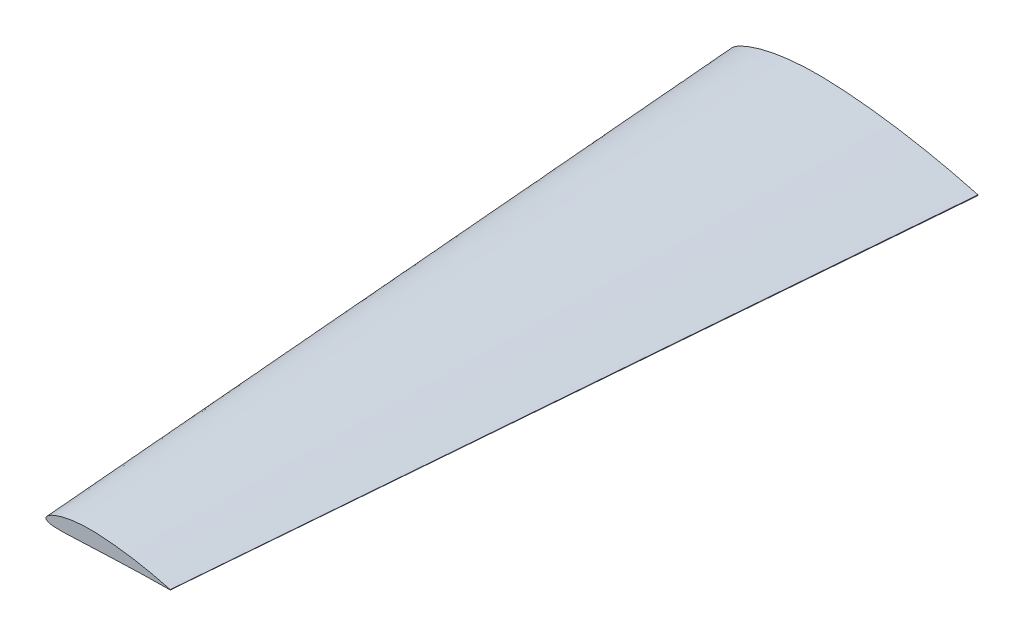
ISO-10303-21;
HEADER;
FILE_DESCRIPTION(('STEP AP214'),'2;1');
FILE_NAME('part.step','',(''),(''),'','','');
FILE_SCHEMA(('AUTOMOTIVE_DESIGN { 1 0 10303 214 1 1 1 1 }'));
ENDSEC;
DATA;
#1=APPLICATION_CONTEXT('core data for automotive mechanical design processes');
#2=APPLICATION_PROTOCOL_DEFINITION('international standard','automotive_design',2000,#1);
#3=PRODUCT_CONTEXT('',#1,'mechanical');
#4=PRODUCT('Part','Part','',(#3));
#5=PRODUCT_RELATED_PRODUCT_CATEGORY('part','',(#4));
#6=PRODUCT_DEFINITION_FORMATION('','',#4);
#7=PRODUCT_DEFINITION_CONTEXT('part definition',#1,'design');
#8=PRODUCT_DEFINITION('design','',#6,#7);
#9=PRODUCT_DEFINITION_SHAPE('','',#8);
#10=(LENGTH_UNIT() NAMED_UNIT(*) SI_UNIT(.MILLI.,.METRE.));
#11=(NAMED_UNIT(*) PLANE_ANGLE_UNIT() SI_UNIT($,.RADIAN.));
#12=(NAMED_UNIT(*) SI_UNIT($,.STERADIAN.) SOLID_ANGLE_UNIT());
#13=UNCERTAINTY_MEASURE_WITH_UNIT(LENGTH_MEASURE(1.E-05),#10,'distance_accuracy_value','');
#14=(GEOMETRIC_REPRESENTATION_CONTEXT(3) GLOBAL_UNCERTAINTY_ASSIGNED_CONTEXT((#13)) GLOBAL_UNIT_ASSIGNED_CONTEXT((#10,
#11,#12)) REPRESENTATION_CONTEXT('',''));
#15=CARTESIAN_POINT('',(0.,0.,0.));
#16=DIRECTION('',(0.,0.,1.));
#17=DIRECTION('',(1.,0.,0.));
#18=AXIS2_PLACEMENT_3D('',#15,#16,#17);
#19=CARTESIAN_POINT('',(63.9870246177536,1.46053907995175,762.));
#20=DIRECTION('',(0.,0.,-1.));
#21=DIRECTION('',(-1.,0.,0.));
#22=AXIS2_PLACEMENT_3D('',#19,#20,#21);
#23=PLANE('',#22);
#24=CARTESIAN_POINT('',(190.501135160856,0.159711835026969,762.));
#25=CARTESIAN_POINT('',(190.196401260815,0.242837402164437,762.));
#26=CARTESIAN_POINT('',(189.345713028998,0.474888846776531,762.));
#27=CARTESIAN_POINT('',(187.801897674633,0.888731591077363,762.));
#28=CARTESIAN_POINT('',(185.759703596292,1.42508607336304,762.));
#29=CARTESIAN_POINT('',(181.395978400603,2.54123887484926,762.));
#30=CARTESIAN_POINT('',(176.64296664211,3.67944944295744,762.));
#31=CARTESIAN_POINT('',(170.423544155164,5.06322299505257,762.));
#32=CARTESIAN_POINT('',(165.907465255672,6.00427842636629,762.));
#33=CARTESIAN_POINT('',(160.045021094237,7.14106385188569,762.));
#34=CARTESIAN_POINT('',(155.215065862349,8.00496895306485,762.));
#35=CARTESIAN_POINT('',(149.076874563435,9.00750201003734,762.));
#36=CARTESIAN_POINT('',(144.111464025191,9.73917687727197,762.));
#37=CARTESIAN_POINT('',(139.129785822539,10.3897489849181,762.));
#38=CARTESIAN_POINT('',(135.399257942975,10.8340394676828,762.));
#39=CARTESIAN_POINT('',(131.685194772388,11.2324457974397,762.));
#40=CARTESIAN_POINT('',(127.996916945445,11.583090543605,762.));
#41=CARTESIAN_POINT('',(124.3432909533,11.8842955510653,762.));
#42=CARTESIAN_POINT('',(120.732775279442,12.1352231638633,762.));
#43=CARTESIAN_POINT('',(117.173407661142,12.3331567906862,762.));
#44=CARTESIAN_POINT('',(113.673279114104,12.4835934855875,762.));
#45=CARTESIAN_POINT('',(110.238900031643,12.5608519442072,762.));
#46=CARTESIAN_POINT('',(106.87792211934,12.559053218761,762.));
#47=CARTESIAN_POINT('',(103.597426735289,12.4821109783776,762.));
#48=CARTESIAN_POINT('',(100.404089450189,12.3320110798951,762.));
#49=CARTESIAN_POINT('',(97.3043914555765,12.1117189870823,762.));
#50=CARTESIAN_POINT('',(94.3045933266868,11.8246590003456,762.));
#51=CARTESIAN_POINT('',(91.410791663912,11.4745298346542,762.));
#52=CARTESIAN_POINT('',(88.6288958848079,11.0655278010128,762.));
#53=CARTESIAN_POINT('',(85.9646564318204,10.6021781245193,762.));
#54=CARTESIAN_POINT('',(83.423666294842,10.0892992981837,762.));
#55=CARTESIAN_POINT('',(81.0113799330289,9.53200275937579,762.));
#56=CARTESIAN_POINT('',(78.7330948960282,8.93566545048852,762.));
#57=CARTESIAN_POINT('',(76.5939937255128,8.30575457375266,762.));
#58=CARTESIAN_POINT('',(74.5991224469136,7.64789101891847,762.));
#59=CARTESIAN_POINT('',(72.7533622745058,6.96779556599871,762.));
#60=CARTESIAN_POINT('',(71.0615072897458,6.27106121856356,762.));
#61=CARTESIAN_POINT('',(69.528158004084,5.56326086551171,762.));
#62=CARTESIAN_POINT('',(68.15777389568,4.84972614842419,762.));
#63=CARTESIAN_POINT('',(66.9545825796964,4.13549625566344,762.));
#64=CARTESIAN_POINT('',(65.9225345441201,3.42515574841331,762.));
#65=CARTESIAN_POINT('',(65.0652400837754,2.72254666043556,762.));
#66=CARTESIAN_POINT('',(64.3858924088571,2.03027344065209,762.));
#67=CARTESIAN_POINT('',(63.8877954466128,1.34882803370603,762.));
#68=CARTESIAN_POINT('',(63.576331156455,0.675261661187566,762.));
#69=CARTESIAN_POINT('',(63.465822923462,0.0133890151793681,762.));
#70=CARTESIAN_POINT('',(63.5650901962065,-0.61763644203103,762.));
#71=CARTESIAN_POINT('',(63.8798671557874,-1.18666144174842,762.));
#72=CARTESIAN_POINT('',(64.387131186621,-1.68063514166978,762.));
#73=CARTESIAN_POINT('',(65.0727851050754,-2.10996667588219,762.));
#74=CARTESIAN_POINT('',(65.9333575925368,-2.4826496151927,762.));
#75=CARTESIAN_POINT('',(66.966748162396,-2.80280567086735,762.));
#76=CARTESIAN_POINT('',(68.1702808429811,-3.07284699802537,762.));
#77=CARTESIAN_POINT('',(69.5405071897431,-3.29457314167147,762.));
#78=CARTESIAN_POINT('',(71.0734430813331,-3.4698766276928,762.));
#79=CARTESIAN_POINT('',(72.7647592058337,-3.60075846595504,762.));
#80=CARTESIAN_POINT('',(74.6098960421376,-3.68939432383372,762.));
#81=CARTESIAN_POINT('',(76.6040996851897,-3.73829785785436,762.));
#82=CARTESIAN_POINT('',(78.7424790794674,-3.75015903606364,762.));
#83=CARTESIAN_POINT('',(81.0199929939404,-3.72796926564423,762.));
#84=CARTESIAN_POINT('',(83.4314693802842,-3.67497138461213,762.));
#85=CARTESIAN_POINT('',(85.9716012917116,-3.59462091577072,762.));
#86=CARTESIAN_POINT('',(88.63493909563,-3.49062839467568,762.));
#87=CARTESIAN_POINT('',(91.4159007115907,-3.36697433226066,762.));
#88=CARTESIAN_POINT('',(94.3087375578435,-3.22768808252554,762.));
#89=CARTESIAN_POINT('',(97.3075514533232,-3.07714046090769,762.));
#90=CARTESIAN_POINT('',(100.406260655434,-2.91966806654462,762.));
#91=CARTESIAN_POINT('',(103.598610516816,-2.75979050739913,762.));
#92=CARTESIAN_POINT('',(106.878142898574,-2.60211997330187,762.));
#93=CARTESIAN_POINT('',(110.238165944358,-2.45069676719206,762.));
#94=CARTESIAN_POINT('',(113.671950709812,-2.31182349124203,762.));
#95=CARTESIAN_POINT('',(117.172359913805,-2.1825344844191,762.));
#96=CARTESIAN_POINT('',(120.731314943635,-2.04023922618981,762.));
#97=CARTESIAN_POINT('',(124.341529513328,-1.89379524646238,762.));
#98=CARTESIAN_POINT('',(129.233791184049,-1.69325168180308,762.));
#99=CARTESIAN_POINT('',(134.166282729182,-1.49318365192342,762.));
#100=CARTESIAN_POINT('',(139.127032284791,-1.30096396691693,762.));
#101=CARTESIAN_POINT('',(144.104534567907,-1.11598363859952,762.));
#102=CARTESIAN_POINT('',(150.288028508105,-0.90382420606474,762.));
#103=CARTESIAN_POINT('',(156.426163442723,-0.72199180046078,762.));
#104=CARTESIAN_POINT('',(162.405617828801,-0.567558932633419,762.));
#105=CARTESIAN_POINT('',(168.122531429816,-0.441227955508521,762.));
#106=CARTESIAN_POINT('',(174.624833220152,-0.328170672402782,762.));
#107=CARTESIAN_POINT('',(179.690292359278,-0.260565816368084,762.));
#108=CARTESIAN_POINT('',(183.370643476354,-0.220528573977313,762.));
#109=CARTESIAN_POINT('',(185.7578348823,-0.19768773229364,762.));
#110=CARTESIAN_POINT('',(187.800598147419,-0.18039888701402,762.));
#111=CARTESIAN_POINT('',(189.345002999198,-0.168516617090277,762.));
#112=CARTESIAN_POINT('',(190.196357675296,-0.162488896159163,762.));
#113=CARTESIAN_POINT('',(190.50113516071,-0.16033102508646,762.));
#114=B_SPLINE_CURVE_WITH_KNOTS('',3,(#24,#25,#26,#27,#28,#29,#30,#31,#32,#33,#34,#35,#36,#37,
#38,#39,#40,#41,#42,#43,#44,#45,#46,#47,#48,#49,#50,#51,#52,#53,#54,#55,#56,#57,#58,#59,#60,#61,
#62,#63,#64,#65,#66,#67,#68,#69,#70,#71,#72,#73,#74,#75,#76,#77,#78,#79,#80,#81,#82,#83,#84,#85,
#86,#87,#88,#89,#90,#91,#92,#93,#94,#95,#96,#97,#98,#99,#100,#101,#102,#103,#104,#105,#106,#107,
#108,#109,#110,#111,#112,#113),.UNSPECIFIED.,.F.,.F.,(4,1,1,1,1,1,1,1,1,1,1,1,1,1,1,1,1,1,1,1,1,
1,1,1,1,1,1,1,1,1,1,1,1,1,1,1,1,1,1,1,1,1,1,1,1,1,1,1,1,1,1,1,1,1,1,1,1,1,1,1,1,1,1,1,1,1,1,1,1,
1,1,1,1,1,1,1,1,1,1,1,1,1,1,1,1,1,1,4),(0.,0.00364478860601825,0.0101747090631396,
0.0184428895215231,0.0280086425425611,0.0621482051960464,0.0748342744760799,0.101528263852082,
0.11537602387302,0.143739831555727,0.158142445863791,0.187141630275424,0.201650652685618,
0.216112766088313,0.230491315406633,0.244751958245146,0.258862484994308,0.272792304761907,
0.286512736995745,0.299996338841716,0.313215703909648,0.326148553126901,0.338775131713446,
0.351076262527233,0.363033565222517,0.37462915444481,0.385845411815831,0.396664985336227,
0.407070812724617,0.417045766343156,0.426572937786423,0.435635427001241,0.444216489802456,
0.452299728153717,0.459869106397838,0.466909557106952,0.473407118007064,0.479350051113446,
0.484729721235626,0.48954271443065,0.493793733281505,0.497501096756629,0.500706184991412,
0.503488944623097,0.505988254688667,0.508338044066672,0.510717789225009,0.513359374079945,
0.516423742324159,0.520004745754894,0.524152160678046,0.528889812630103,0.534226438538837,
0.540161492649376,0.546688627737685,0.553797384371451,0.561474607341898,0.569704904431302,
0.578471268576388,0.587755198196961,0.597537024239713,0.60779607747483,0.618510576434459,
0.629658046042943,0.641215051436608,0.653157357960514,0.665460089527627,0.67809762264025,
0.691043448063763,0.704270528446116,0.717752207957266,0.731462063587203,0.745369962337874,
0.759444617882347,0.787961110672762,0.802332596700765,0.816729476151824,0.84543596003295,
0.873725531950303,0.887588045862428,0.914455616234269,0.939708694258762,0.962629026381722,
0.972910877872026,0.982178639029259,0.990176001122399,0.996483094815023,1.),.UNSPECIFIED.);
#115=CARTESIAN_POINT('',(190.501135161374,0.159710881655824,762.));
#116=VERTEX_POINT('',#115);
#117=CARTESIAN_POINT('',(190.501135161301,-0.160330071715315,762.));
#118=VERTEX_POINT('',#117);
#119=EDGE_CURVE('E63',#116,#118,#114,.T.);
#120=ORIENTED_EDGE('',*,*,#119,.T.);
#121=DIRECTION('',(-2.28433846985782E-10,-1.,0.));
#122=VECTOR('',#121,1.);
#123=CARTESIAN_POINT('',(190.501135161374,0.159710881655824,762.));
#124=LINE('',#123,#122);
#125=EDGE_CURVE('E12',#116,#118,#124,.T.);
#126=ORIENTED_EDGE('',*,*,#125,.F.);
#127=EDGE_LOOP('',(#120,#126));
#128=FACE_BOUND('',#127,.T.);
#129=ADVANCED_FACE('F53',(#128),#23,.F.);
#130=CARTESIAN_POINT('',(0.97404013916288,2.92167112415054,0.));
#131=DIRECTION('',(0.,0.,-1.));
#132=DIRECTION('',(-1.,0.,0.));
#133=AXIS2_PLACEMENT_3D('',#130,#131,#132);
#134=PLANE('',#133);
#135=CARTESIAN_POINT('',(254.,0.32004,0.));
#136=CARTESIAN_POINT('',(253.390537646446,0.486289648267037,0.));
#137=CARTESIAN_POINT('',(251.689176387219,0.950388389185326,0.));
#138=CARTESIAN_POINT('',(248.601573271209,1.77806647963455,0.));
#139=CARTESIAN_POINT('',(244.517221614816,2.85076585590718,0.));
#140=CARTESIAN_POINT('',(235.789849216653,5.08305150554154,0.));
#141=CARTESIAN_POINT('',(226.283910650703,7.35945229381868,0.));
#142=CARTESIAN_POINT('',(213.845176837243,10.1269746597052,0.));
#143=CARTESIAN_POINT('',(204.813099754701,12.0090686984258,0.));
#144=CARTESIAN_POINT('',(193.088316212104,14.2826192259836,0.));
#145=CARTESIAN_POINT('',(183.428492074849,16.0104139830805,0.));
#146=CARTESIAN_POINT('',(171.152219185932,18.0154621728274,0.));
#147=CARTESIAN_POINT('',(161.221486857123,19.4787988253041,0.));
#148=CARTESIAN_POINT('',(151.25821949033,20.779931408164,0.));
#149=CARTESIAN_POINT('',(143.797230407695,21.6685044293409,0.));
#150=CARTESIAN_POINT('',(136.369170448777,22.465309964619,0.));
#151=CARTESIAN_POINT('',(128.992680716324,23.1665931863953,0.));
#152=CARTESIAN_POINT('',(121.685494034167,23.7689978144454,0.));
#153=CARTESIAN_POINT('',(114.464527218106,24.270848551834,0.));
#154=CARTESIAN_POINT('',(107.345855599024,24.6667122644973,0.));
#155=CARTESIAN_POINT('',(100.34566106371,24.9675829622992,0.));
#156=CARTESIAN_POINT('',(93.4769642824573,25.1220984955356,0.));
#157=CARTESIAN_POINT('',(86.7550685296698,25.1185010737212,0.));
#158=CARTESIAN_POINT('',(80.1941363949661,24.9646179651698,0.));
#159=CARTESIAN_POINT('',(73.8075189004262,24.6644208480695,0.));
#160=CARTESIAN_POINT('',(67.6081783132815,24.2238405969616,0.));
#161=CARTESIAN_POINT('',(61.6086356721016,23.6497257514606,0.));
#162=CARTESIAN_POINT('',(55.8210840687007,22.9494736754026,0.));
#163=CARTESIAN_POINT('',(50.257342232566,22.1314769157999,0.));
#164=CARTESIAN_POINT('',(44.9289109458054,21.204785841973,0.));
#165=CARTESIAN_POINT('',(39.8469760882345,20.1790373538249,0.));
#166=CARTESIAN_POINT('',(35.0224464806717,19.0644542347415,0.));
#167=CARTESIAN_POINT('',(30.4659171277217,17.8717902734098,0.));
#168=CARTESIAN_POINT('',(26.1877530200956,16.611979776579,0.));
#169=CARTESIAN_POINT('',(22.1980461184611,15.2962644232903,0.));
#170=CARTESIAN_POINT('',(18.5065587641201,13.9360856713245,0.));
#171=CARTESIAN_POINT('',(15.1228790342938,12.5426294278608,0.));
#172=CARTESIAN_POINT('',(12.056207869652,11.1270413710947,0.));
#173=CARTESIAN_POINT('',(9.31546414680269,9.69998468889821,0.));
#174=CARTESIAN_POINT('',(6.90910302050575,8.27153766793319,0.));
#175=CARTESIAN_POINT('',(4.84502539612194,6.85086934862954,0.));
#176=CARTESIAN_POINT('',(3.13045179876857,5.4456637298443,0.));
#177=CARTESIAN_POINT('',(1.77176859175951,4.06112966287395,0.));
#178=CARTESIAN_POINT('',(0.775583570537433,2.69825102821515,0.));
#179=CARTESIAN_POINT('',(0.152660557736857,1.3511303217576,0.));
#180=CARTESIAN_POINT('',(-0.0683539324959022,0.0273968594985317,0.));
#181=CARTESIAN_POINT('',(0.130178839334364,-1.23464277631474,0.));
#182=CARTESIAN_POINT('',(0.759727132908438,-2.37268260509879,0.));
#183=CARTESIAN_POINT('',(1.77424612853707,-3.36062117553042,0.));
#184=CARTESIAN_POINT('',(3.14554171092971,-4.21927656975095,0.));
#185=CARTESIAN_POINT('',(4.86667130490995,-4.964635786506,0.));
#186=CARTESIAN_POINT('',(6.93343397480551,-5.60494217466098,0.));
#187=CARTESIAN_POINT('',(9.3404778251038,-6.14502000134356,0.));
#188=CARTESIAN_POINT('',(12.0809060283431,-6.58846832440248,0.));
#189=CARTESIAN_POINT('',(15.1467504130371,-6.93907216178997,0.));
#190=CARTESIAN_POINT('',(18.5293524327319,-7.20083349747666,0.));
#191=CARTESIAN_POINT('',(22.2195931267088,-7.37810362733138,0.));
#192=CARTESIAN_POINT('',(26.2079647698278,-7.47590981948216,0.));
#193=CARTESIAN_POINT('',(30.4846853384653,-7.49963196194819,0.));
#194=CARTESIAN_POINT('',(35.0396724606673,-7.45525281563302,0.));
#195=CARTESIAN_POINT('',(39.8625821322293,-7.34925799861311,0.));
#196=CARTESIAN_POINT('',(44.9428005544326,-7.18855849473847,0.));
#197=CARTESIAN_POINT('',(50.2694285594988,-6.98057530880581,0.));
#198=CARTESIAN_POINT('',(55.8313020863041,-6.73326939154266,0.));
#199=CARTESIAN_POINT('',(61.6169240740981,-6.45469937893608,0.));
#200=CARTESIAN_POINT('',(67.6144982661743,-6.15360682374524,0.));
#201=CARTESIAN_POINT('',(73.8118612860454,-5.83866484674134,0.));
#202=CARTESIAN_POINT('',(80.1965039507901,-5.51891258307528,0.));
#203=CARTESIAN_POINT('',(86.7555100980449,-5.20357432997919,0.));
#204=CARTESIAN_POINT('',(93.4754961347248,-4.900730621124,0.));
#205=CARTESIAN_POINT('',(100.34300429239,-4.62298654821206,0.));
#206=CARTESIAN_POINT('',(107.34376013634,-4.36441084219083,0.));
#207=CARTESIAN_POINT('',(114.461606585545,-4.07982286576818,0.));
#208=CARTESIAN_POINT('',(121.681971198295,-3.78693752045383,0.));
#209=CARTESIAN_POINT('',(131.46640709862,-3.38585397104318,0.));
#210=CARTESIAN_POINT('',(141.331302028729,-2.98572148265566,0.));
#211=CARTESIAN_POINT('',(151.252712474731,-2.60128554371272,0.));
#212=CARTESIAN_POINT('',(161.207628076326,-2.23132818874134,0.));
#213=CARTESIAN_POINT('',(173.574505436994,-1.80701311001391,0.));
#214=CARTESIAN_POINT('',(185.850665597245,-1.44335154314506,0.));
#215=CARTESIAN_POINT('',(197.809467496588,-1.13448856225385,0.));
#216=CARTESIAN_POINT('',(209.243192518303,-0.881828860733514,0.));
#217=CARTESIAN_POINT('',(222.247679881184,-0.655716309288913,0.));
#218=CARTESIAN_POINT('',(232.378507622826,-0.52050780091379,0.));
#219=CARTESIAN_POINT('',(239.739144076866,-0.440434028367526,0.));
#220=CARTESIAN_POINT('',(244.513484221714,-0.394752751060409,0.));
#221=CARTESIAN_POINT('',(248.598974240985,-0.36017536764354,0.));
#222=CARTESIAN_POINT('',(251.687756340897,-0.336411038760385,0.));
#223=CARTESIAN_POINT('',(253.390450476558,-0.324355703855585,0.));
#224=CARTESIAN_POINT('',(254.,-0.32004,0.));
#225=B_SPLINE_CURVE_WITH_KNOTS('',3,(#135,#136,#137,#138,#139,#140,#141,#142,#143,#144,#145,
#146,#147,#148,#149,#150,#151,#152,#153,#154,#155,#156,#157,#158,#159,#160,#161,#162,#163,#164,
#165,#166,#167,#168,#169,#170,#171,#172,#173,#174,#175,#176,#177,#178,#179,#180,#181,#182,#183,
#184,#185,#186,#187,#188,#189,#190,#191,#192,#193,#194,#195,#196,#197,#198,#199,#200,#201,#202,
#203,#204,#205,#206,#207,#208,#209,#210,#211,#212,#213,#214,#215,#216,#217,#218,#219,#220,#221,
#222,#223,#224),.UNSPECIFIED.,.F.,.F.,(4,1,1,1,1,1,1,1,1,1,1,1,1,1,1,1,1,1,1,1,1,1,1,1,1,1,1,1,
1,1,1,1,1,1,1,1,1,1,1,1,1,1,1,1,1,1,1,1,1,1,1,1,1,1,1,1,1,1,1,1,1,1,1,1,1,1,1,1,1,1,1,1,1,1,1,1,
1,1,1,1,1,1,1,1,1,1,1,4),(0.,0.00364478860601825,0.0101747090631396,0.0184428895215231,
0.0280086425425611,0.0621482051960464,0.0748342744760799,0.101528263852082,0.11537602387302,
0.143739831555727,0.158142445863791,0.187141630275424,0.201650652685618,0.216112766088313,
0.230491315406633,0.244751958245146,0.258862484994308,0.272792304761907,0.286512736995745,
0.299996338841716,0.313215703909648,0.326148553126901,0.338775131713446,0.351076262527233,
0.363033565222517,0.37462915444481,0.385845411815831,0.396664985336227,0.407070812724617,
0.417045766343156,0.426572937786423,0.435635427001241,0.444216489802456,0.452299728153717,
0.459869106397838,0.466909557106952,0.473407118007064,0.479350051113446,0.484729721235626,
0.48954271443065,0.493793733281505,0.497501096756629,0.500706184991412,0.503488944623097,
0.505988254688667,0.508338044066672,0.510717789225009,0.513359374079945,0.516423742324159,
0.520004745754894,0.524152160678046,0.528889812630103,0.534226438538837,0.540161492649376,
0.546688627737685,0.553797384371451,0.561474607341898,0.569704904431302,0.578471268576388,
0.587755198196961,0.597537024239713,0.60779607747483,0.618510576434459,0.629658046042943,
0.641215051436608,0.653157357960514,0.665460089527627,0.67809762264025,0.691043448063763,
0.704270528446116,0.717752207957266,0.731462063587203,0.745369962337874,0.759444617882347,
0.787961110672762,0.802332596700765,0.816729476151824,0.84543596003295,0.873725531950303,
0.887588045862428,0.914455616234269,0.939708694258762,0.962629026381722,0.972910877872026,
0.982178639029259,0.990176001122399,0.996483094815023,1.),.UNSPECIFIED.);
#226=CARTESIAN_POINT('',(254.,0.32004,0.));
#227=VERTEX_POINT('',#226);
#228=CARTESIAN_POINT('',(254.,-0.32004,0.));
#229=VERTEX_POINT('',#228);
#230=EDGE_CURVE('E87',#227,#229,#225,.T.);
#231=ORIENTED_EDGE('',*,*,#230,.F.);
#232=DIRECTION('',(0.,1.,0.));
#233=VECTOR('',#232,1.);
#234=CARTESIAN_POINT('',(254.,0.32004,0.));
#235=LINE('',#234,#233);
#236=EDGE_CURVE('E91',#229,#227,#235,.T.);
#237=ORIENTED_EDGE('',*,*,#236,.F.);
#238=EDGE_LOOP('',(#231,#237));
#239=FACE_BOUND('',#238,.T.);
#240=ADVANCED_FACE('F100',(#239),#134,.T.);
#241=CARTESIAN_POINT('',(254.,0.32004,0.));
#242=CARTESIAN_POINT('',(190.501135160856,0.159711835026969,762.));
#243=CARTESIAN_POINT('',(253.390537646446,0.486289648267037,0.));
#244=CARTESIAN_POINT('',(190.196401260815,0.242837402164437,762.));
#245=CARTESIAN_POINT('',(251.689176387219,0.950388389185326,0.));
#246=CARTESIAN_POINT('',(189.345713028998,0.474888846776531,762.));
#247=CARTESIAN_POINT('',(248.601573271209,1.77806647963455,0.));
#248=CARTESIAN_POINT('',(187.801897674633,0.888731591077363,762.));
#249=CARTESIAN_POINT('',(244.517221614816,2.85076585590718,0.));
#250=CARTESIAN_POINT('',(185.759703596292,1.42508607336304,762.));
#251=CARTESIAN_POINT('',(235.789849216653,5.08305150554154,0.));
#252=CARTESIAN_POINT('',(181.395978400603,2.54123887484926,762.));
#253=CARTESIAN_POINT('',(226.283910650703,7.35945229381868,0.));
#254=CARTESIAN_POINT('',(176.64296664211,3.67944944295744,762.));
#255=CARTESIAN_POINT('',(213.845176837243,10.1269746597052,0.));
#256=CARTESIAN_POINT('',(170.423544155164,5.06322299505257,762.));
#257=CARTESIAN_POINT('',(204.813099754701,12.0090686984258,0.));
#258=CARTESIAN_POINT('',(165.907465255672,6.00427842636629,762.));
#259=CARTESIAN_POINT('',(193.088316212104,14.2826192259836,0.));
#260=CARTESIAN_POINT('',(160.045021094237,7.14106385188569,762.));
#261=CARTESIAN_POINT('',(183.428492074849,16.0104139830805,0.));
#262=CARTESIAN_POINT('',(155.215065862349,8.00496895306485,762.));
#263=CARTESIAN_POINT('',(171.152219185932,18.0154621728274,0.));
#264=CARTESIAN_POINT('',(149.076874563435,9.00750201003734,762.));
#265=CARTESIAN_POINT('',(161.221486857123,19.4787988253041,0.));
#266=CARTESIAN_POINT('',(144.111464025191,9.73917687727197,762.));
#267=CARTESIAN_POINT('',(151.25821949033,20.779931408164,0.));
#268=CARTESIAN_POINT('',(139.129785822539,10.3897489849181,762.));
#269=CARTESIAN_POINT('',(143.797230407695,21.6685044293409,0.));
#270=CARTESIAN_POINT('',(135.399257942975,10.8340394676828,762.));
#271=CARTESIAN_POINT('',(136.369170448777,22.465309964619,0.));
#272=CARTESIAN_POINT('',(131.685194772388,11.2324457974397,762.));
#273=CARTESIAN_POINT('',(128.992680716324,23.1665931863953,0.));
#274=CARTESIAN_POINT('',(127.996916945445,11.583090543605,762.));
#275=CARTESIAN_POINT('',(121.685494034167,23.7689978144454,0.));
#276=CARTESIAN_POINT('',(124.3432909533,11.8842955510653,762.));
#277=CARTESIAN_POINT('',(114.464527218106,24.270848551834,0.));
#278=CARTESIAN_POINT('',(120.732775279442,12.1352231638633,762.));
#279=CARTESIAN_POINT('',(107.345855599024,24.6667122644973,0.));
#280=CARTESIAN_POINT('',(117.173407661142,12.3331567906862,762.));
#281=CARTESIAN_POINT('',(100.34566106371,24.9675829622992,0.));
#282=CARTESIAN_POINT('',(113.673279114104,12.4835934855875,762.));
#283=CARTESIAN_POINT('',(93.4769642824573,25.1220984955356,0.));
#284=CARTESIAN_POINT('',(110.238900031643,12.5608519442072,762.));
#285=CARTESIAN_POINT('',(86.7550685296698,25.1185010737212,0.));
#286=CARTESIAN_POINT('',(106.87792211934,12.559053218761,762.));
#287=CARTESIAN_POINT('',(80.1941363949661,24.9646179651698,0.));
#288=CARTESIAN_POINT('',(103.597426735289,12.4821109783776,762.));
#289=CARTESIAN_POINT('',(73.8075189004262,24.6644208480695,0.));
#290=CARTESIAN_POINT('',(100.404089450189,12.3320110798951,762.));
#291=CARTESIAN_POINT('',(67.6081783132815,24.2238405969616,0.));
#292=CARTESIAN_POINT('',(97.3043914555765,12.1117189870823,762.));
#293=CARTESIAN_POINT('',(61.6086356721016,23.6497257514606,0.));
#294=CARTESIAN_POINT('',(94.3045933266868,11.8246590003456,762.));
#295=CARTESIAN_POINT('',(55.8210840687007,22.9494736754026,0.));
#296=CARTESIAN_POINT('',(91.410791663912,11.4745298346542,762.));
#297=CARTESIAN_POINT('',(50.257342232566,22.1314769157999,0.));
#298=CARTESIAN_POINT('',(88.6288958848079,11.0655278010128,762.));
#299=CARTESIAN_POINT('',(44.9289109458054,21.204785841973,0.));
#300=CARTESIAN_POINT('',(85.9646564318204,10.6021781245193,762.));
#301=CARTESIAN_POINT('',(39.8469760882345,20.1790373538249,0.));
#302=CARTESIAN_POINT('',(83.423666294842,10.0892992981837,762.));
#303=CARTESIAN_POINT('',(35.0224464806717,19.0644542347415,0.));
#304=CARTESIAN_POINT('',(81.0113799330289,9.53200275937579,762.));
#305=CARTESIAN_POINT('',(30.4659171277217,17.8717902734098,0.));
#306=CARTESIAN_POINT('',(78.7330948960282,8.93566545048852,762.));
#307=CARTESIAN_POINT('',(26.1877530200956,16.611979776579,0.));
#308=CARTESIAN_POINT('',(76.5939937255128,8.30575457375266,762.));
#309=CARTESIAN_POINT('',(22.1980461184611,15.2962644232903,0.));
#310=CARTESIAN_POINT('',(74.5991224469136,7.64789101891847,762.));
#311=CARTESIAN_POINT('',(18.5065587641201,13.9360856713245,0.));
#312=CARTESIAN_POINT('',(72.7533622745058,6.96779556599871,762.));
#313=CARTESIAN_POINT('',(15.1228790342938,12.5426294278608,0.));
#314=CARTESIAN_POINT('',(71.0615072897458,6.27106121856356,762.));
#315=CARTESIAN_POINT('',(12.056207869652,11.1270413710947,0.));
#316=CARTESIAN_POINT('',(69.528158004084,5.56326086551171,762.));
#317=CARTESIAN_POINT('',(9.31546414680269,9.69998468889821,0.));
#318=CARTESIAN_POINT('',(68.15777389568,4.84972614842419,762.));
#319=CARTESIAN_POINT('',(6.90910302050575,8.27153766793319,0.));
#320=CARTESIAN_POINT('',(66.9545825796964,4.13549625566344,762.));
#321=CARTESIAN_POINT('',(4.84502539612194,6.85086934862954,0.));
#322=CARTESIAN_POINT('',(65.9225345441201,3.42515574841331,762.));
#323=CARTESIAN_POINT('',(3.13045179876857,5.4456637298443,0.));
#324=CARTESIAN_POINT('',(65.0652400837754,2.72254666043556,762.));
#325=CARTESIAN_POINT('',(1.77176859175951,4.06112966287395,0.));
#326=CARTESIAN_POINT('',(64.3858924088571,2.03027344065209,762.));
#327=CARTESIAN_POINT('',(0.775583570537433,2.69825102821515,0.));
#328=CARTESIAN_POINT('',(63.8877954466128,1.34882803370603,762.));
#329=CARTESIAN_POINT('',(0.152660557736857,1.3511303217576,0.));
#330=CARTESIAN_POINT('',(63.576331156455,0.675261661187566,762.));
#331=CARTESIAN_POINT('',(-0.0683539324959022,0.0273968594985317,0.));
#332=CARTESIAN_POINT('',(63.465822923462,0.0133890151793681,762.));
#333=CARTESIAN_POINT('',(0.130178839334364,-1.23464277631474,0.));
#334=CARTESIAN_POINT('',(63.5650901962065,-0.61763644203103,762.));
#335=CARTESIAN_POINT('',(0.759727132908438,-2.37268260509879,0.));
#336=CARTESIAN_POINT('',(63.8798671557874,-1.18666144174842,762.));
#337=CARTESIAN_POINT('',(1.77424612853707,-3.36062117553042,0.));
#338=CARTESIAN_POINT('',(64.387131186621,-1.68063514166978,762.));
#339=CARTESIAN_POINT('',(3.14554171092971,-4.21927656975095,0.));
#340=CARTESIAN_POINT('',(65.0727851050754,-2.10996667588219,762.));
#341=CARTESIAN_POINT('',(4.86667130490995,-4.964635786506,0.));
#342=CARTESIAN_POINT('',(65.9333575925368,-2.4826496151927,762.));
#343=CARTESIAN_POINT('',(6.93343397480551,-5.60494217466098,0.));
#344=CARTESIAN_POINT('',(66.966748162396,-2.80280567086735,762.));
#345=CARTESIAN_POINT('',(9.3404778251038,-6.14502000134356,0.));
#346=CARTESIAN_POINT('',(68.1702808429811,-3.07284699802537,762.));
#347=CARTESIAN_POINT('',(12.0809060283431,-6.58846832440248,0.));
#348=CARTESIAN_POINT('',(69.5405071897431,-3.29457314167147,762.));
#349=CARTESIAN_POINT('',(15.1467504130371,-6.93907216178997,0.));
#350=CARTESIAN_POINT('',(71.0734430813331,-3.4698766276928,762.));
#351=CARTESIAN_POINT('',(18.5293524327319,-7.20083349747666,0.));
#352=CARTESIAN_POINT('',(72.7647592058337,-3.60075846595504,762.));
#353=CARTESIAN_POINT('',(22.2195931267088,-7.37810362733138,0.));
#354=CARTESIAN_POINT('',(74.6098960421376,-3.68939432383372,762.));
#355=CARTESIAN_POINT('',(26.2079647698278,-7.47590981948216,0.));
#356=CARTESIAN_POINT('',(76.6040996851897,-3.73829785785436,762.));
#357=CARTESIAN_POINT('',(30.4846853384653,-7.49963196194819,0.));
#358=CARTESIAN_POINT('',(78.7424790794674,-3.75015903606364,762.));
#359=CARTESIAN_POINT('',(35.0396724606673,-7.45525281563302,0.));
#360=CARTESIAN_POINT('',(81.0199929939404,-3.72796926564423,762.));
#361=CARTESIAN_POINT('',(39.8625821322293,-7.34925799861311,0.));
#362=CARTESIAN_POINT('',(83.4314693802842,-3.67497138461213,762.));
#363=CARTESIAN_POINT('',(44.9428005544326,-7.18855849473847,0.));
#364=CARTESIAN_POINT('',(85.9716012917116,-3.59462091577072,762.));
#365=CARTESIAN_POINT('',(50.2694285594988,-6.98057530880581,0.));
#366=CARTESIAN_POINT('',(88.63493909563,-3.49062839467568,762.));
#367=CARTESIAN_POINT('',(55.8313020863041,-6.73326939154266,0.));
#368=CARTESIAN_POINT('',(91.4159007115907,-3.36697433226066,762.));
#369=CARTESIAN_POINT('',(61.6169240740981,-6.45469937893608,0.));
#370=CARTESIAN_POINT('',(94.3087375578435,-3.22768808252554,762.));
#371=CARTESIAN_POINT('',(67.6144982661743,-6.15360682374524,0.));
#372=CARTESIAN_POINT('',(97.3075514533232,-3.07714046090769,762.));
#373=CARTESIAN_POINT('',(73.8118612860454,-5.83866484674134,0.));
#374=CARTESIAN_POINT('',(100.406260655434,-2.91966806654462,762.));
#375=CARTESIAN_POINT('',(80.1965039507901,-5.51891258307528,0.));
#376=CARTESIAN_POINT('',(103.598610516816,-2.75979050739913,762.));
#377=CARTESIAN_POINT('',(86.7555100980449,-5.20357432997919,0.));
#378=CARTESIAN_POINT('',(106.878142898574,-2.60211997330187,762.));
#379=CARTESIAN_POINT('',(93.4754961347248,-4.900730621124,0.));
#380=CARTESIAN_POINT('',(110.238165944358,-2.45069676719206,762.));
#381=CARTESIAN_POINT('',(100.34300429239,-4.62298654821206,0.));
#382=CARTESIAN_POINT('',(113.671950709812,-2.31182349124203,762.));
#383=CARTESIAN_POINT('',(107.34376013634,-4.36441084219083,0.));
#384=CARTESIAN_POINT('',(117.172359913805,-2.1825344844191,762.));
#385=CARTESIAN_POINT('',(114.461606585545,-4.07982286576818,0.));
#386=CARTESIAN_POINT('',(120.731314943635,-2.04023922618981,762.));
#387=CARTESIAN_POINT('',(121.681971198295,-3.78693752045383,0.));
#388=CARTESIAN_POINT('',(124.341529513328,-1.89379524646238,762.));
#389=CARTESIAN_POINT('',(131.46640709862,-3.38585397104318,0.));
#390=CARTESIAN_POINT('',(129.233791184049,-1.69325168180308,762.));
#391=CARTESIAN_POINT('',(141.331302028729,-2.98572148265566,0.));
#392=CARTESIAN_POINT('',(134.166282729182,-1.49318365192342,762.));
#393=CARTESIAN_POINT('',(151.252712474731,-2.60128554371272,0.));
#394=CARTESIAN_POINT('',(139.127032284791,-1.30096396691693,762.));
#395=CARTESIAN_POINT('',(161.207628076326,-2.23132818874134,0.));
#396=CARTESIAN_POINT('',(144.104534567907,-1.11598363859952,762.));
#397=CARTESIAN_POINT('',(173.574505436994,-1.80701311001391,0.));
#398=CARTESIAN_POINT('',(150.288028508105,-0.90382420606474,762.));
#399=CARTESIAN_POINT('',(185.850665597245,-1.44335154314506,0.));
#400=CARTESIAN_POINT('',(156.426163442723,-0.72199180046078,762.));
#401=CARTESIAN_POINT('',(197.809467496588,-1.13448856225385,0.));
#402=CARTESIAN_POINT('',(162.405617828801,-0.567558932633419,762.));
#403=CARTESIAN_POINT('',(209.243192518303,-0.881828860733514,0.));
#404=CARTESIAN_POINT('',(168.122531429816,-0.441227955508521,762.));
#405=CARTESIAN_POINT('',(222.247679881184,-0.655716309288913,0.));
#406=CARTESIAN_POINT('',(174.624833220152,-0.328170672402782,762.));
#407=CARTESIAN_POINT('',(232.378507622826,-0.52050780091379,0.));
#408=CARTESIAN_POINT('',(179.690292359278,-0.260565816368084,762.));
#409=CARTESIAN_POINT('',(239.739144076866,-0.440434028367526,0.));
#410=CARTESIAN_POINT('',(183.370643476354,-0.220528573977313,762.));
#411=CARTESIAN_POINT('',(244.513484221714,-0.394752751060409,0.));
#412=CARTESIAN_POINT('',(185.7578348823,-0.19768773229364,762.));
#413=CARTESIAN_POINT('',(248.598974240985,-0.36017536764354,0.));
#414=CARTESIAN_POINT('',(187.800598147419,-0.18039888701402,762.));
#415=CARTESIAN_POINT('',(251.687756340897,-0.336411038760385,0.));
#416=CARTESIAN_POINT('',(189.345002999198,-0.168516617090277,762.));
#417=CARTESIAN_POINT('',(253.390450476558,-0.324355703855585,0.));
#418=CARTESIAN_POINT('',(190.196357675296,-0.162488896159163,762.));
#419=CARTESIAN_POINT('',(254.,-0.32004,0.));
#420=CARTESIAN_POINT('',(190.50113516071,-0.16033102508646,762.));
#421=B_SPLINE_SURFACE_WITH_KNOTS('',3,1,((#241,#242),(#243,#244),(#245,#246),(#247,#248),(#249,
#250),(#251,#252),(#253,#254),(#255,#256),(#257,#258),(#259,#260),(#261,#262),(#263,#264),(#265,
#266),(#267,#268),(#269,#270),(#271,#272),(#273,#274),(#275,#276),(#277,#278),(#279,#280),(#281,
#282),(#283,#284),(#285,#286),(#287,#288),(#289,#290),(#291,#292),(#293,#294),(#295,#296),(#297,
#298),(#299,#300),(#301,#302),(#303,#304),(#305,#306),(#307,#308),(#309,#310),(#311,#312),(#313,
#314),(#315,#316),(#317,#318),(#319,#320),(#321,#322),(#323,#324),(#325,#326),(#327,#328),(#329,
#330),(#331,#332),(#333,#334),(#335,#336),(#337,#338),(#339,#340),(#341,#342),(#343,#344),(#345,
#346),(#347,#348),(#349,#350),(#351,#352),(#353,#354),(#355,#356),(#357,#358),(#359,#360),(#361,
#362),(#363,#364),(#365,#366),(#367,#368),(#369,#370),(#371,#372),(#373,#374),(#375,#376),(#377,
#378),(#379,#380),(#381,#382),(#383,#384),(#385,#386),(#387,#388),(#389,#390),(#391,#392),(#393,
#394),(#395,#396),(#397,#398),(#399,#400),(#401,#402),(#403,#404),(#405,#406),(#407,#408),(#409,
#410),(#411,#412),(#413,#414),(#415,#416),(#417,#418),(#419,#420)),.UNSPECIFIED.,.F.,.F.,.F.,(4,
1,1,1,1,1,1,1,1,1,1,1,1,1,1,1,1,1,1,1,1,1,1,1,1,1,1,1,1,1,1,1,1,1,1,1,1,1,1,1,1,1,1,1,1,1,1,1,1,
1,1,1,1,1,1,1,1,1,1,1,1,1,1,1,1,1,1,1,1,1,1,1,1,1,1,1,1,1,1,1,1,1,1,1,1,1,1,4),(2,2),(0.,
0.00364478860601825,0.0101747090631396,0.0184428895215231,0.0280086425425611,0.0621482051960464,
0.0748342744760799,0.101528263852082,0.11537602387302,0.143739831555727,0.158142445863791,
0.187141630275424,0.201650652685618,0.216112766088313,0.230491315406633,0.244751958245146,
0.258862484994308,0.272792304761907,0.286512736995745,0.299996338841716,0.313215703909648,
0.326148553126901,0.338775131713446,0.351076262527233,0.363033565222517,0.37462915444481,
0.385845411815831,0.396664985336227,0.407070812724617,0.417045766343156,0.426572937786423,
0.435635427001241,0.444216489802456,0.452299728153717,0.459869106397838,0.466909557106952,
0.473407118007064,0.479350051113446,0.484729721235626,0.48954271443065,0.493793733281505,
0.497501096756629,0.500706184991412,0.503488944623097,0.505988254688667,0.508338044066672,
0.510717789225009,0.513359374079945,0.516423742324159,0.520004745754894,0.524152160678046,
0.528889812630103,0.534226438538837,0.540161492649376,0.546688627737685,0.553797384371451,
0.561474607341898,0.569704904431302,0.578471268576388,0.587755198196961,0.597537024239713,
0.60779607747483,0.618510576434459,0.629658046042943,0.641215051436608,0.653157357960514,
0.665460089527627,0.67809762264025,0.691043448063763,0.704270528446116,0.717752207957266,
0.731462063587203,0.745369962337874,0.759444617882347,0.787961110672762,0.802332596700765,
0.816729476151824,0.84543596003295,0.873725531950303,0.887588045862428,0.914455616234269,
0.939708694258762,0.962629026381722,0.972910877872026,0.982178639029259,0.990176001122399,
0.996483094815023,1.),(0.,1.),.UNSPECIFIED.);
#422=DIRECTION('',(-0.0830440037140342,0.000208867870936776,0.996545859366921));
#423=VECTOR('',#422,1.);
#424=CARTESIAN_POINT('',(222.250567580355,-0.24018551254323,381.));
#425=LINE('',#424,#423);
#426=EDGE_CURVE('E71',#229,#118,#425,.T.);
#427=DIRECTION('',(0.0830440036997713,0.000209677649496978,-0.996545859198058));
#428=VECTOR('',#427,1.);
#429=CARTESIAN_POINT('',(222.250567580428,0.239875917513484,381.));
#430=LINE('',#429,#428);
#431=EDGE_CURVE('E83',#116,#227,#430,.T.);
#432=ORIENTED_EDGE('',*,*,#230,.T.);
#433=ORIENTED_EDGE('',*,*,#426,.T.);
#434=ORIENTED_EDGE('',*,*,#119,.F.);
#435=ORIENTED_EDGE('',*,*,#431,.T.);
#436=EDGE_LOOP('',(#432,#433,#434,#435));
#437=FACE_BOUND('',#436,.T.);
#438=ADVANCED_FACE('F85',(#437),#421,.T.);
#439=CARTESIAN_POINT('',(222.250567580687,0.239875440827912,381.));
#440=DIRECTION('',(0.996545881104539,-7.58625479224226E-11,0.083044005524649));
#441=DIRECTION('',(0.083044005524649,0.,-0.996545881104539));
#442=AXIS2_PLACEMENT_3D('',#439,#440,#441);
#443=PLANE('',#442);
#444=ORIENTED_EDGE('',*,*,#431,.F.);
#445=ORIENTED_EDGE('',*,*,#125,.T.);
#446=ORIENTED_EDGE('',*,*,#426,.F.);
#447=ORIENTED_EDGE('',*,*,#236,.T.);
#448=EDGE_LOOP('',(#444,#445,#446,#447));
#449=FACE_BOUND('',#448,.T.);
#450=ADVANCED_FACE('F94',(#449),#443,.T.);
#451=CLOSED_SHELL('',(#129,#240,#438,#450));
#452=MANIFOLD_SOLID_BREP('B2',#451);
#453=ADVANCED_BREP_SHAPE_REPRESENTATION('',(#18,#452),#14);
#454=SHAPE_DEFINITION_REPRESENTATION(#9,#453);
ENDSEC;
END-ISO-10303-21;
